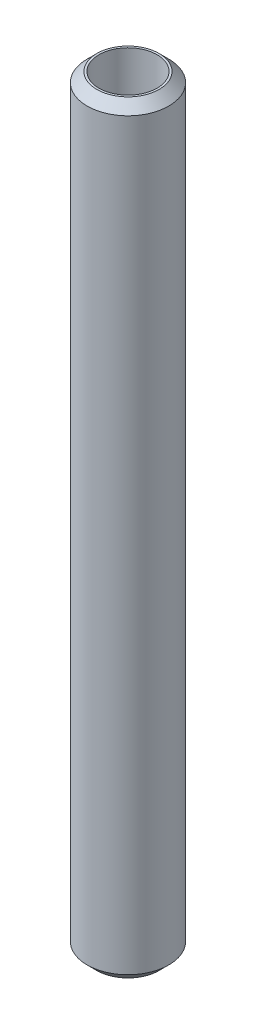
ISO-10303-21;
HEADER;
FILE_DESCRIPTION(('STEP AP214'),'2;1');
FILE_NAME('part.step','',(''),(''),'','','');
FILE_SCHEMA(('AUTOMOTIVE_DESIGN { 1 0 10303 214 1 1 1 1 }'));
ENDSEC;
DATA;
#1=APPLICATION_CONTEXT('core data for automotive mechanical design processes');
#2=APPLICATION_PROTOCOL_DEFINITION('international standard','automotive_design',2000,#1);
#3=PRODUCT_CONTEXT('',#1,'mechanical');
#4=PRODUCT('Part','Part','',(#3));
#5=PRODUCT_RELATED_PRODUCT_CATEGORY('part','',(#4));
#6=PRODUCT_DEFINITION_FORMATION('','',#4);
#7=PRODUCT_DEFINITION_CONTEXT('part definition',#1,'design');
#8=PRODUCT_DEFINITION('design','',#6,#7);
#9=PRODUCT_DEFINITION_SHAPE('','',#8);
#10=(LENGTH_UNIT() NAMED_UNIT(*) SI_UNIT(.MILLI.,.METRE.));
#11=(NAMED_UNIT(*) PLANE_ANGLE_UNIT() SI_UNIT($,.RADIAN.));
#12=(NAMED_UNIT(*) SI_UNIT($,.STERADIAN.) SOLID_ANGLE_UNIT());
#13=UNCERTAINTY_MEASURE_WITH_UNIT(LENGTH_MEASURE(1.E-05),#10,'distance_accuracy_value','');
#14=(GEOMETRIC_REPRESENTATION_CONTEXT(3) GLOBAL_UNCERTAINTY_ASSIGNED_CONTEXT((#13)) GLOBAL_UNIT_ASSIGNED_CONTEXT((#10,
#11,#12)) REPRESENTATION_CONTEXT('',''));
#15=CARTESIAN_POINT('',(0.,0.,0.));
#16=DIRECTION('',(0.,0.,1.));
#17=DIRECTION('',(1.,0.,0.));
#18=AXIS2_PLACEMENT_3D('',#15,#16,#17);
#19=CARTESIAN_POINT('',(0.,327.471653787313,0.));
#20=DIRECTION('',(0.,-1.,0.));
#21=DIRECTION('',(0.,0.,-1.));
#22=AXIS2_PLACEMENT_3D('',#19,#20,#21);
#23=CYLINDRICAL_SURFACE('',#22,17.5);
#24=CARTESIAN_POINT('',(0.,323.348765877237,0.));
#25=DIRECTION('',(0.,1.,0.));
#26=DIRECTION('',(0.,0.,1.));
#27=AXIS2_PLACEMENT_3D('',#24,#25,#26);
#28=CIRCLE('',#27,17.5);
#29=CARTESIAN_POINT('',(0.,323.348765877237,17.5));
#30=VERTEX_POINT('',#29);
#31=EDGE_CURVE('E50',#30,#30,#28,.F.);
#32=ORIENTED_EDGE('',*,*,#31,.T.);
#33=EDGE_LOOP('',(#32));
#34=FACE_BOUND('',#33,.T.);
#35=CARTESIAN_POINT('',(0.,4.1228879100757,0.));
#36=DIRECTION('',(0.,1.,0.));
#37=DIRECTION('',(0.,0.,1.));
#38=AXIS2_PLACEMENT_3D('',#35,#36,#37);
#39=CIRCLE('',#38,17.5);
#40=CARTESIAN_POINT('',(0.,4.1228879100757,17.5));
#41=VERTEX_POINT('',#40);
#42=EDGE_CURVE('E51',#41,#41,#39,.T.);
#43=ORIENTED_EDGE('',*,*,#42,.T.);
#44=EDGE_LOOP('',(#43));
#45=FACE_BOUND('',#44,.T.);
#46=ADVANCED_FACE('F39',(#34,#45),#23,.T.);
#47=CARTESIAN_POINT('',(0.,327.471653787313,0.));
#48=DIRECTION('',(0.,1.,0.));
#49=DIRECTION('',(0.,0.,1.));
#50=AXIS2_PLACEMENT_3D('',#47,#48,#49);
#51=PLANE('',#50);
#52=CARTESIAN_POINT('',(0.,327.471653787313,0.));
#53=DIRECTION('',(0.,1.,0.));
#54=DIRECTION('',(0.,0.,1.));
#55=AXIS2_PLACEMENT_3D('',#52,#53,#54);
#56=CIRCLE('',#55,13.3771120899242);
#57=CARTESIAN_POINT('',(0.,327.471653787313,13.3771120899242));
#58=VERTEX_POINT('',#57);
#59=EDGE_CURVE('E54',#58,#58,#56,.T.);
#60=ORIENTED_EDGE('',*,*,#59,.T.);
#61=EDGE_LOOP('',(#60));
#62=FACE_BOUND('',#61,.T.);
#63=CARTESIAN_POINT('',(0.,327.471653787313,0.));
#64=DIRECTION('',(0.,1.,0.));
#65=DIRECTION('',(0.,0.,1.));
#66=AXIS2_PLACEMENT_3D('',#63,#64,#65);
#67=CIRCLE('',#66,12.4667026664818);
#68=CARTESIAN_POINT('',(0.,327.471653787313,12.4667026664818));
#69=VERTEX_POINT('',#68);
#70=EDGE_CURVE('E58',#69,#69,#67,.T.);
#71=ORIENTED_EDGE('',*,*,#70,.F.);
#72=EDGE_LOOP('',(#71));
#73=FACE_BOUND('',#72,.T.);
#74=ADVANCED_FACE('F69',(#62,#73),#51,.T.);
#75=CARTESIAN_POINT('',(0.,0.,0.));
#76=DIRECTION('',(0.,1.,0.));
#77=DIRECTION('',(0.,0.,1.));
#78=AXIS2_PLACEMENT_3D('',#75,#76,#77);
#79=PLANE('',#78);
#80=CARTESIAN_POINT('',(0.,0.,0.));
#81=DIRECTION('',(0.,1.,0.));
#82=DIRECTION('',(0.,0.,1.));
#83=AXIS2_PLACEMENT_3D('',#80,#81,#82);
#84=CIRCLE('',#83,13.3771120899243);
#85=CARTESIAN_POINT('',(0.,0.,13.3771120899243));
#86=VERTEX_POINT('',#85);
#87=EDGE_CURVE('E10',#86,#86,#84,.F.);
#88=ORIENTED_EDGE('',*,*,#87,.T.);
#89=EDGE_LOOP('',(#88));
#90=FACE_BOUND('',#89,.T.);
#91=CARTESIAN_POINT('',(0.,0.,0.));
#92=DIRECTION('',(0.,1.,0.));
#93=DIRECTION('',(0.,0.,1.));
#94=AXIS2_PLACEMENT_3D('',#91,#92,#93);
#95=CIRCLE('',#94,12.4667026664818);
#96=CARTESIAN_POINT('',(0.,0.,12.4667026664818));
#97=VERTEX_POINT('',#96);
#98=EDGE_CURVE('E63',#97,#97,#95,.T.);
#99=ORIENTED_EDGE('',*,*,#98,.T.);
#100=EDGE_LOOP('',(#99));
#101=FACE_BOUND('',#100,.T.);
#102=ADVANCED_FACE('F75',(#90,#101),#79,.F.);
#103=CARTESIAN_POINT('',(0.,327.471653787313,0.));
#104=DIRECTION('',(0.,-1.,0.));
#105=DIRECTION('',(0.,0.,-1.));
#106=AXIS2_PLACEMENT_3D('',#103,#104,#105);
#107=CYLINDRICAL_SURFACE('',#106,12.4667026664818);
#108=ORIENTED_EDGE('',*,*,#70,.T.);
#109=EDGE_LOOP('',(#108));
#110=FACE_BOUND('',#109,.T.);
#111=ORIENTED_EDGE('',*,*,#98,.F.);
#112=EDGE_LOOP('',(#111));
#113=FACE_BOUND('',#112,.T.);
#114=ADVANCED_FACE('F70',(#110,#113),#107,.F.);
#115=CARTESIAN_POINT('',(0.,327.471653787313,0.));
#116=DIRECTION('',(0.,-1.,0.));
#117=DIRECTION('',(0.,0.,-1.));
#118=AXIS2_PLACEMENT_3D('',#115,#116,#117);
#119=CONICAL_SURFACE('',#118,13.3771120899242,0.785398163397444);
#120=ORIENTED_EDGE('',*,*,#31,.F.);
#121=EDGE_LOOP('',(#120));
#122=FACE_BOUND('',#121,.T.);
#123=ORIENTED_EDGE('',*,*,#59,.F.);
#124=EDGE_LOOP('',(#123));
#125=FACE_BOUND('',#124,.T.);
#126=ADVANCED_FACE('F81',(#122,#125),#119,.T.);
#127=CARTESIAN_POINT('',(0.,4.1228879100757,0.));
#128=DIRECTION('',(0.,1.,0.));
#129=DIRECTION('',(0.,0.,1.));
#130=AXIS2_PLACEMENT_3D('',#127,#128,#129);
#131=CONICAL_SURFACE('',#130,17.5,0.785398163397454);
#132=ORIENTED_EDGE('',*,*,#87,.F.);
#133=EDGE_LOOP('',(#132));
#134=FACE_BOUND('',#133,.T.);
#135=ORIENTED_EDGE('',*,*,#42,.F.);
#136=EDGE_LOOP('',(#135));
#137=FACE_BOUND('',#136,.T.);
#138=ADVANCED_FACE('F45',(#134,#137),#131,.T.);
#139=CLOSED_SHELL('',(#46,#74,#102,#114,#126,#138));
#140=MANIFOLD_SOLID_BREP('B2',#139);
#141=ADVANCED_BREP_SHAPE_REPRESENTATION('',(#18,#140),#14);
#142=SHAPE_DEFINITION_REPRESENTATION(#9,#141);
ENDSEC;
END-ISO-10303-21;
